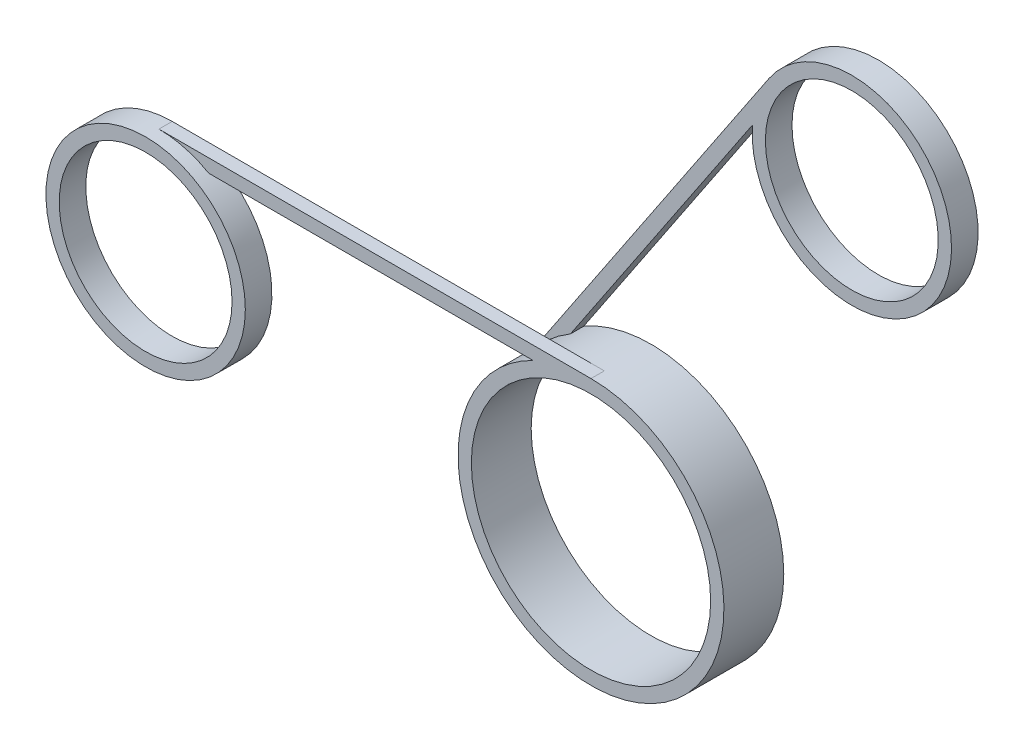
ISO-10303-21;
HEADER;
FILE_DESCRIPTION(('STEP AP214'),'2;1');
FILE_NAME('part.step','',(''),(''),'','','');
FILE_SCHEMA(('AUTOMOTIVE_DESIGN { 1 0 10303 214 1 1 1 1 }'));
ENDSEC;
DATA;
#1=APPLICATION_CONTEXT('core data for automotive mechanical design processes');
#2=APPLICATION_PROTOCOL_DEFINITION('international standard','automotive_design',2000,#1);
#3=PRODUCT_CONTEXT('',#1,'mechanical');
#4=PRODUCT('Part','Part','',(#3));
#5=PRODUCT_RELATED_PRODUCT_CATEGORY('part','',(#4));
#6=PRODUCT_DEFINITION_FORMATION('','',#4);
#7=PRODUCT_DEFINITION_CONTEXT('part definition',#1,'design');
#8=PRODUCT_DEFINITION('design','',#6,#7);
#9=PRODUCT_DEFINITION_SHAPE('','',#8);
#10=(LENGTH_UNIT() NAMED_UNIT(*) SI_UNIT(.MILLI.,.METRE.));
#11=(NAMED_UNIT(*) PLANE_ANGLE_UNIT() SI_UNIT($,.RADIAN.));
#12=(NAMED_UNIT(*) SI_UNIT($,.STERADIAN.) SOLID_ANGLE_UNIT());
#13=UNCERTAINTY_MEASURE_WITH_UNIT(LENGTH_MEASURE(1.E-05),#10,'distance_accuracy_value','');
#14=(GEOMETRIC_REPRESENTATION_CONTEXT(3) GLOBAL_UNCERTAINTY_ASSIGNED_CONTEXT((#13)) GLOBAL_UNIT_ASSIGNED_CONTEXT((#10,
#11,#12)) REPRESENTATION_CONTEXT('',''));
#15=CARTESIAN_POINT('',(0.,0.,0.));
#16=DIRECTION('',(0.,0.,1.));
#17=DIRECTION('',(1.,0.,0.));
#18=AXIS2_PLACEMENT_3D('',#15,#16,#17);
#19=CARTESIAN_POINT('',(10.7164950382095,32.1827826275243,1.));
#20=DIRECTION('',(0.830988464290159,-0.55628964777055,0.));
#21=DIRECTION('',(0.55628964777055,0.830988464290159,0.));
#22=AXIS2_PLACEMENT_3D('',#19,#20,#21);
#23=PLANE('',#22);
#24=DIRECTION('',(-0.55628964777055,-0.830988464290159,0.));
#25=VECTOR('',#24,1.);
#26=CARTESIAN_POINT('',(10.7164950382095,32.1827826275243,0.));
#27=LINE('',#26,#25);
#28=CARTESIAN_POINT('',(8.63502380081733,29.0734697112104,0.));
#29=VERTEX_POINT('',#28);
#30=CARTESIAN_POINT('',(-5.0494654380512,8.63150617157437,0.));
#31=VERTEX_POINT('',#30);
#32=EDGE_CURVE('E117',#29,#31,#27,.T.);
#33=ORIENTED_EDGE('',*,*,#32,.F.);
#34=DIRECTION('',(0.,0.,1.));
#35=VECTOR('',#34,1.);
#36=CARTESIAN_POINT('',(8.63502380081733,29.0734697112104,-1.));
#37=LINE('',#36,#35);
#38=CARTESIAN_POINT('',(8.63502380081733,29.0734697112104,1.));
#39=VERTEX_POINT('',#38);
#40=EDGE_CURVE('E106',#29,#39,#37,.T.);
#41=ORIENTED_EDGE('',*,*,#40,.T.);
#42=DIRECTION('',(-0.55628964777055,-0.830988464290159,0.));
#43=VECTOR('',#42,1.);
#44=CARTESIAN_POINT('',(10.7164950382095,32.1827826275243,1.));
#45=LINE('',#44,#43);
#46=CARTESIAN_POINT('',(-5.04946543805121,8.63150617157437,1.));
#47=VERTEX_POINT('',#46);
#48=EDGE_CURVE('E51',#39,#47,#45,.T.);
#49=ORIENTED_EDGE('',*,*,#48,.T.);
#50=DIRECTION('',(0.,0.,-1.));
#51=VECTOR('',#50,1.);
#52=CARTESIAN_POINT('',(-5.0494654380512,8.63150617157437,4.5));
#53=LINE('',#52,#51);
#54=EDGE_CURVE('E133',#31,#47,#53,.F.);
#55=ORIENTED_EDGE('',*,*,#54,.F.);
#56=EDGE_LOOP('',(#33,#41,#49,#55));
#57=FACE_BOUND('',#56,.T.);
#58=ADVANCED_FACE('F36',(#57),#23,.T.);
#59=CARTESIAN_POINT('',(0.,9.,3.5));
#60=DIRECTION('',(0.,-1.,0.));
#61=DIRECTION('',(0.,0.,-1.));
#62=AXIS2_PLACEMENT_3D('',#59,#60,#61);
#63=PLANE('',#62);
#64=DIRECTION('',(1.,0.,0.));
#65=VECTOR('',#64,1.);
#66=CARTESIAN_POINT('',(0.,9.,4.5));
#67=LINE('',#66,#65);
#68=CARTESIAN_POINT('',(-28.7583426132261,9.,4.5));
#69=VERTEX_POINT('',#68);
#70=CARTESIAN_POINT('',(-4.35889894354067,9.,4.5));
#71=VERTEX_POINT('',#70);
#72=EDGE_CURVE('E157',#69,#71,#67,.T.);
#73=ORIENTED_EDGE('',*,*,#72,.F.);
#74=DIRECTION('',(0.,0.,-1.));
#75=VECTOR('',#74,1.);
#76=CARTESIAN_POINT('',(-28.7583426132261,9.,5.5));
#77=LINE('',#76,#75);
#78=CARTESIAN_POINT('',(-28.7583426132261,9.,3.5));
#79=VERTEX_POINT('',#78);
#80=EDGE_CURVE('E149',#69,#79,#77,.T.);
#81=ORIENTED_EDGE('',*,*,#80,.T.);
#82=DIRECTION('',(1.,0.,0.));
#83=VECTOR('',#82,1.);
#84=CARTESIAN_POINT('',(0.,9.,3.5));
#85=LINE('',#84,#83);
#86=CARTESIAN_POINT('',(-4.35889894354067,9.,3.5));
#87=VERTEX_POINT('',#86);
#88=EDGE_CURVE('E156',#79,#87,#85,.T.);
#89=ORIENTED_EDGE('',*,*,#88,.T.);
#90=DIRECTION('',(0.,0.,-1.));
#91=VECTOR('',#90,1.);
#92=CARTESIAN_POINT('',(-4.35889894354067,9.,4.5));
#93=LINE('',#92,#91);
#94=EDGE_CURVE('E171',#71,#87,#93,.T.);
#95=ORIENTED_EDGE('',*,*,#94,.F.);
#96=EDGE_LOOP('',(#73,#81,#89,#95));
#97=FACE_BOUND('',#96,.T.);
#98=ADVANCED_FACE('F193',(#97),#63,.T.);
#99=CARTESIAN_POINT('',(0.,0.,4.5));
#100=DIRECTION('',(0.,0.,-1.));
#101=DIRECTION('',(-1.,0.,0.));
#102=AXIS2_PLACEMENT_3D('',#99,#100,#101);
#103=CYLINDRICAL_SURFACE('',#102,10.);
#104=CARTESIAN_POINT('',(0.,0.,0.));
#105=DIRECTION('',(0.,0.,1.));
#106=DIRECTION('',(1.,0.,0.));
#107=AXIS2_PLACEMENT_3D('',#104,#105,#106);
#108=CIRCLE('',#107,10.);
#109=CARTESIAN_POINT('',(-8.19409693482487,5.73208299160904,0.));
#110=VERTEX_POINT('',#109);
#111=EDGE_CURVE('E40',#110,#31,#108,.T.);
#112=ORIENTED_EDGE('',*,*,#111,.T.);
#113=ORIENTED_EDGE('',*,*,#54,.T.);
#114=CARTESIAN_POINT('',(0.,0.,1.));
#115=DIRECTION('',(0.,0.,-1.));
#116=DIRECTION('',(-1.,0.,0.));
#117=AXIS2_PLACEMENT_3D('',#114,#115,#116);
#118=CIRCLE('',#117,10.);
#119=CARTESIAN_POINT('',(-8.19409693482483,5.7320829916091,1.));
#120=VERTEX_POINT('',#119);
#121=EDGE_CURVE('E58',#120,#47,#118,.T.);
#122=ORIENTED_EDGE('',*,*,#121,.F.);
#123=DIRECTION('',(0.,0.,-1.));
#124=VECTOR('',#123,1.);
#125=CARTESIAN_POINT('',(-8.19409693482487,5.73208299160904,1.));
#126=LINE('',#125,#124);
#127=EDGE_CURVE('E122',#120,#110,#126,.T.);
#128=ORIENTED_EDGE('',*,*,#127,.T.);
#129=EDGE_LOOP('',(#112,#113,#122,#128));
#130=FACE_BOUND('',#129,.T.);
#131=CARTESIAN_POINT('',(0.,0.,4.5));
#132=DIRECTION('',(0.,0.,1.));
#133=DIRECTION('',(1.,0.,0.));
#134=AXIS2_PLACEMENT_3D('',#131,#132,#133);
#135=CIRCLE('',#134,10.);
#136=CARTESIAN_POINT('',(0.,10.,4.5));
#137=VERTEX_POINT('',#136);
#138=EDGE_CURVE('E11',#71,#137,#135,.T.);
#139=ORIENTED_EDGE('',*,*,#138,.F.);
#140=ORIENTED_EDGE('',*,*,#94,.T.);
#141=CARTESIAN_POINT('',(0.,0.,3.5));
#142=DIRECTION('',(0.,0.,-1.));
#143=DIRECTION('',(-1.,0.,0.));
#144=AXIS2_PLACEMENT_3D('',#141,#142,#143);
#145=CIRCLE('',#144,10.);
#146=CARTESIAN_POINT('',(0.,10.,3.5));
#147=VERTEX_POINT('',#146);
#148=EDGE_CURVE('E166',#87,#147,#145,.T.);
#149=ORIENTED_EDGE('',*,*,#148,.T.);
#150=DIRECTION('',(0.,0.,1.));
#151=VECTOR('',#150,1.);
#152=CARTESIAN_POINT('',(0.,10.,3.5));
#153=LINE('',#152,#151);
#154=EDGE_CURVE('E159',#147,#137,#153,.T.);
#155=ORIENTED_EDGE('',*,*,#154,.T.);
#156=EDGE_LOOP('',(#139,#140,#149,#155));
#157=FACE_BOUND('',#156,.T.);
#158=ADVANCED_FACE('F38',(#130,#157),#103,.T.);
#159=CARTESIAN_POINT('',(0.,0.,4.5));
#160=DIRECTION('',(0.,0.,1.));
#161=DIRECTION('',(1.,0.,0.));
#162=AXIS2_PLACEMENT_3D('',#159,#160,#161);
#163=PLANE('',#162);
#164=DIRECTION('',(-1.,0.,0.));
#165=VECTOR('',#164,1.);
#166=CARTESIAN_POINT('',(0.,10.,4.5));
#167=LINE('',#166,#165);
#168=CARTESIAN_POINT('',(-32.5,10.,4.5));
#169=VERTEX_POINT('',#168);
#170=EDGE_CURVE('E152',#137,#169,#167,.T.);
#171=ORIENTED_EDGE('',*,*,#170,.T.);
#172=CARTESIAN_POINT('',(-32.5,2.5,4.5));
#173=DIRECTION('',(0.,0.,1.));
#174=DIRECTION('',(1.,0.,0.));
#175=AXIS2_PLACEMENT_3D('',#172,#173,#174);
#176=CIRCLE('',#175,7.5);
#177=EDGE_CURVE('E145',#169,#69,#176,.F.);
#178=ORIENTED_EDGE('',*,*,#177,.T.);
#179=ORIENTED_EDGE('',*,*,#72,.T.);
#180=ORIENTED_EDGE('',*,*,#138,.T.);
#181=EDGE_LOOP('',(#171,#178,#179,#180));
#182=FACE_BOUND('',#181,.T.);
#183=CARTESIAN_POINT('',(0.,0.,4.5));
#184=DIRECTION('',(0.,0.,1.));
#185=DIRECTION('',(1.,0.,0.));
#186=AXIS2_PLACEMENT_3D('',#183,#184,#185);
#187=CIRCLE('',#186,9.);
#188=CARTESIAN_POINT('',(9.,0.,4.5));
#189=VERTEX_POINT('',#188);
#190=EDGE_CURVE('E174',#189,#189,#187,.T.);
#191=ORIENTED_EDGE('',*,*,#190,.F.);
#192=EDGE_LOOP('',(#191));
#193=FACE_BOUND('',#192,.T.);
#194=ADVANCED_FACE('F183',(#182,#193),#163,.T.);
#195=CARTESIAN_POINT('',(0.,0.,0.));
#196=DIRECTION('',(0.,0.,1.));
#197=DIRECTION('',(1.,0.,0.));
#198=AXIS2_PLACEMENT_3D('',#195,#196,#197);
#199=PLANE('',#198);
#200=CARTESIAN_POINT('',(16.1178940884926,28.5668611267723,0.));
#201=DIRECTION('',(0.,0.,1.));
#202=DIRECTION('',(1.,0.,0.));
#203=AXIS2_PLACEMENT_3D('',#200,#201,#202);
#204=CIRCLE('',#203,7.5);
#205=CARTESIAN_POINT('',(9.88551056893519,32.7390782430246,0.));
#206=VERTEX_POINT('',#205);
#207=EDGE_CURVE('E119',#29,#206,#204,.F.);
#208=ORIENTED_EDGE('',*,*,#207,.F.);
#209=ORIENTED_EDGE('',*,*,#32,.T.);
#210=ORIENTED_EDGE('',*,*,#111,.F.);
#211=DIRECTION('',(0.556295615500309,0.830984469274325,0.));
#212=VECTOR('',#211,1.);
#213=CARTESIAN_POINT('',(-8.19409693482487,5.73208299160904,0.));
#214=LINE('',#213,#212);
#215=EDGE_CURVE('E118',#110,#206,#214,.T.);
#216=ORIENTED_EDGE('',*,*,#215,.T.);
#217=EDGE_LOOP('',(#208,#209,#210,#216));
#218=FACE_BOUND('',#217,.T.);
#219=CARTESIAN_POINT('',(0.,0.,0.));
#220=DIRECTION('',(0.,0.,1.));
#221=DIRECTION('',(1.,0.,0.));
#222=AXIS2_PLACEMENT_3D('',#219,#220,#221);
#223=CIRCLE('',#222,9.);
#224=CARTESIAN_POINT('',(9.,0.,0.));
#225=VERTEX_POINT('',#224);
#226=EDGE_CURVE('E175',#225,#225,#223,.T.);
#227=ORIENTED_EDGE('',*,*,#226,.T.);
#228=EDGE_LOOP('',(#227));
#229=FACE_BOUND('',#228,.T.);
#230=ADVANCED_FACE('F185',(#218,#229),#199,.F.);
#231=CARTESIAN_POINT('',(0.,0.,0.));
#232=DIRECTION('',(0.,0.,1.));
#233=DIRECTION('',(1.,0.,0.));
#234=AXIS2_PLACEMENT_3D('',#231,#232,#233);
#235=CYLINDRICAL_SURFACE('',#234,9.);
#236=ORIENTED_EDGE('',*,*,#226,.F.);
#237=EDGE_LOOP('',(#236));
#238=FACE_BOUND('',#237,.T.);
#239=ORIENTED_EDGE('',*,*,#190,.T.);
#240=EDGE_LOOP('',(#239));
#241=FACE_BOUND('',#240,.T.);
#242=ADVANCED_FACE('F181',(#238,#241),#235,.F.);
#243=CARTESIAN_POINT('',(0.,0.,3.5));
#244=DIRECTION('',(0.,0.,-1.));
#245=DIRECTION('',(-1.,0.,0.));
#246=AXIS2_PLACEMENT_3D('',#243,#244,#245);
#247=PLANE('',#246);
#248=CARTESIAN_POINT('',(-32.5,2.5,3.5));
#249=DIRECTION('',(0.,0.,1.));
#250=DIRECTION('',(1.,0.,0.));
#251=AXIS2_PLACEMENT_3D('',#248,#249,#250);
#252=CIRCLE('',#251,6.5);
#253=CARTESIAN_POINT('',(-26.,2.5,3.5));
#254=VERTEX_POINT('',#253);
#255=EDGE_CURVE('E136',#254,#254,#252,.T.);
#256=ORIENTED_EDGE('',*,*,#255,.T.);
#257=EDGE_LOOP('',(#256));
#258=FACE_BOUND('',#257,.T.);
#259=ORIENTED_EDGE('',*,*,#88,.F.);
#260=CARTESIAN_POINT('',(-32.5,2.5,3.5));
#261=DIRECTION('',(0.,0.,1.));
#262=DIRECTION('',(1.,0.,0.));
#263=AXIS2_PLACEMENT_3D('',#260,#261,#262);
#264=CIRCLE('',#263,7.5);
#265=CARTESIAN_POINT('',(-32.5,10.,3.5));
#266=VERTEX_POINT('',#265);
#267=EDGE_CURVE('E139',#266,#79,#264,.T.);
#268=ORIENTED_EDGE('',*,*,#267,.F.);
#269=DIRECTION('',(-1.,0.,0.));
#270=VECTOR('',#269,1.);
#271=CARTESIAN_POINT('',(0.,10.,3.5));
#272=LINE('',#271,#270);
#273=EDGE_CURVE('E153',#147,#266,#272,.T.);
#274=ORIENTED_EDGE('',*,*,#273,.F.);
#275=ORIENTED_EDGE('',*,*,#148,.F.);
#276=EDGE_LOOP('',(#259,#268,#274,#275));
#277=FACE_BOUND('',#276,.T.);
#278=ADVANCED_FACE('F222',(#258,#277),#247,.T.);
#279=CARTESIAN_POINT('',(0.,10.,3.5));
#280=DIRECTION('',(0.,1.,0.));
#281=DIRECTION('',(-1.,0.,0.));
#282=AXIS2_PLACEMENT_3D('',#279,#280,#281);
#283=PLANE('',#282);
#284=ORIENTED_EDGE('',*,*,#170,.F.);
#285=ORIENTED_EDGE('',*,*,#154,.F.);
#286=ORIENTED_EDGE('',*,*,#273,.T.);
#287=DIRECTION('',(0.,0.,1.));
#288=VECTOR('',#287,1.);
#289=CARTESIAN_POINT('',(-32.5,10.,3.5));
#290=LINE('',#289,#288);
#291=EDGE_CURVE('E163',#266,#169,#290,.T.);
#292=ORIENTED_EDGE('',*,*,#291,.T.);
#293=EDGE_LOOP('',(#284,#285,#286,#292));
#294=FACE_BOUND('',#293,.T.);
#295=ADVANCED_FACE('F220',(#294),#283,.T.);
#296=CARTESIAN_POINT('',(-32.5,2.5,5.5));
#297=DIRECTION('',(0.,0.,-1.));
#298=DIRECTION('',(-1.,0.,0.));
#299=AXIS2_PLACEMENT_3D('',#296,#297,#298);
#300=CYLINDRICAL_SURFACE('',#299,7.5);
#301=ORIENTED_EDGE('',*,*,#80,.F.);
#302=ORIENTED_EDGE('',*,*,#177,.F.);
#303=ORIENTED_EDGE('',*,*,#291,.F.);
#304=ORIENTED_EDGE('',*,*,#267,.T.);
#305=EDGE_LOOP('',(#301,#302,#303,#304));
#306=FACE_BOUND('',#305,.T.);
#307=CARTESIAN_POINT('',(-32.5,2.5,5.5));
#308=DIRECTION('',(0.,0.,1.));
#309=DIRECTION('',(1.,0.,0.));
#310=AXIS2_PLACEMENT_3D('',#307,#308,#309);
#311=CIRCLE('',#310,7.5);
#312=CARTESIAN_POINT('',(-25.,2.5,5.5));
#313=VERTEX_POINT('',#312);
#314=EDGE_CURVE('E142',#313,#313,#311,.T.);
#315=ORIENTED_EDGE('',*,*,#314,.F.);
#316=EDGE_LOOP('',(#315));
#317=FACE_BOUND('',#316,.T.);
#318=ADVANCED_FACE('F216',(#306,#317),#300,.T.);
#319=CARTESIAN_POINT('',(-32.5,2.5,5.5));
#320=DIRECTION('',(0.,0.,1.));
#321=DIRECTION('',(1.,0.,0.));
#322=AXIS2_PLACEMENT_3D('',#319,#320,#321);
#323=PLANE('',#322);
#324=CARTESIAN_POINT('',(-32.5,2.5,5.5));
#325=DIRECTION('',(0.,0.,1.));
#326=DIRECTION('',(1.,0.,0.));
#327=AXIS2_PLACEMENT_3D('',#324,#325,#326);
#328=CIRCLE('',#327,6.5);
#329=CARTESIAN_POINT('',(-26.,2.5,5.5));
#330=VERTEX_POINT('',#329);
#331=EDGE_CURVE('E135',#330,#330,#328,.T.);
#332=ORIENTED_EDGE('',*,*,#331,.F.);
#333=EDGE_LOOP('',(#332));
#334=FACE_BOUND('',#333,.T.);
#335=ORIENTED_EDGE('',*,*,#314,.T.);
#336=EDGE_LOOP('',(#335));
#337=FACE_BOUND('',#336,.T.);
#338=ADVANCED_FACE('F212',(#334,#337),#323,.T.);
#339=CARTESIAN_POINT('',(-32.5,2.5,3.5));
#340=DIRECTION('',(0.,0.,1.));
#341=DIRECTION('',(1.,0.,0.));
#342=AXIS2_PLACEMENT_3D('',#339,#340,#341);
#343=CYLINDRICAL_SURFACE('',#342,6.5);
#344=ORIENTED_EDGE('',*,*,#255,.F.);
#345=EDGE_LOOP('',(#344));
#346=FACE_BOUND('',#345,.T.);
#347=ORIENTED_EDGE('',*,*,#331,.T.);
#348=EDGE_LOOP('',(#347));
#349=FACE_BOUND('',#348,.T.);
#350=ADVANCED_FACE('F209',(#346,#349),#343,.F.);
#351=CARTESIAN_POINT('',(0.,0.,1.));
#352=DIRECTION('',(0.,0.,-1.));
#353=DIRECTION('',(-1.,0.,0.));
#354=AXIS2_PLACEMENT_3D('',#351,#352,#353);
#355=PLANE('',#354);
#356=CARTESIAN_POINT('',(16.1178940884926,28.5668611267723,1.));
#357=DIRECTION('',(0.,0.,-1.));
#358=DIRECTION('',(-1.,0.,0.));
#359=AXIS2_PLACEMENT_3D('',#356,#357,#358);
#360=CIRCLE('',#359,6.5);
#361=CARTESIAN_POINT('',(9.61789408849261,28.5668611267723,1.));
#362=VERTEX_POINT('',#361);
#363=EDGE_CURVE('E114',#362,#362,#360,.T.);
#364=ORIENTED_EDGE('',*,*,#363,.T.);
#365=EDGE_LOOP('',(#364));
#366=FACE_BOUND('',#365,.T.);
#367=ORIENTED_EDGE('',*,*,#48,.F.);
#368=CARTESIAN_POINT('',(16.1178940884926,28.5668611267723,1.));
#369=DIRECTION('',(0.,0.,-1.));
#370=DIRECTION('',(-1.,0.,0.));
#371=AXIS2_PLACEMENT_3D('',#368,#369,#370);
#372=CIRCLE('',#371,7.5);
#373=CARTESIAN_POINT('',(9.88551056893517,32.7390782430246,1.));
#374=VERTEX_POINT('',#373);
#375=EDGE_CURVE('E103',#374,#39,#372,.T.);
#376=ORIENTED_EDGE('',*,*,#375,.F.);
#377=DIRECTION('',(0.556295615500309,0.830984469274325,0.));
#378=VECTOR('',#377,1.);
#379=CARTESIAN_POINT('',(-8.19409693482487,5.73208299160904,1.));
#380=LINE('',#379,#378);
#381=EDGE_CURVE('E123',#120,#374,#380,.T.);
#382=ORIENTED_EDGE('',*,*,#381,.F.);
#383=ORIENTED_EDGE('',*,*,#121,.T.);
#384=EDGE_LOOP('',(#367,#376,#382,#383));
#385=FACE_BOUND('',#384,.T.);
#386=ADVANCED_FACE('F121',(#366,#385),#355,.F.);
#387=CARTESIAN_POINT('',(-8.19409693482487,5.73208299160904,1.));
#388=DIRECTION('',(-0.830984469274325,0.556295615500309,0.));
#389=DIRECTION('',(-0.556295615500309,-0.830984469274325,0.));
#390=AXIS2_PLACEMENT_3D('',#387,#388,#389);
#391=PLANE('',#390);
#392=ORIENTED_EDGE('',*,*,#215,.F.);
#393=ORIENTED_EDGE('',*,*,#127,.F.);
#394=ORIENTED_EDGE('',*,*,#381,.T.);
#395=DIRECTION('',(0.,0.,-1.));
#396=VECTOR('',#395,1.);
#397=CARTESIAN_POINT('',(9.88551056893519,32.7390782430246,1.));
#398=LINE('',#397,#396);
#399=EDGE_CURVE('E109',#374,#206,#398,.T.);
#400=ORIENTED_EDGE('',*,*,#399,.T.);
#401=EDGE_LOOP('',(#392,#393,#394,#400));
#402=FACE_BOUND('',#401,.T.);
#403=ADVANCED_FACE('F205',(#402),#391,.T.);
#404=CARTESIAN_POINT('',(16.1178940884926,28.5668611267723,-1.));
#405=DIRECTION('',(0.,0.,1.));
#406=DIRECTION('',(1.,0.,0.));
#407=AXIS2_PLACEMENT_3D('',#404,#405,#406);
#408=CYLINDRICAL_SURFACE('',#407,7.5);
#409=ORIENTED_EDGE('',*,*,#40,.F.);
#410=ORIENTED_EDGE('',*,*,#207,.T.);
#411=ORIENTED_EDGE('',*,*,#399,.F.);
#412=ORIENTED_EDGE('',*,*,#375,.T.);
#413=EDGE_LOOP('',(#409,#410,#411,#412));
#414=FACE_BOUND('',#413,.T.);
#415=CARTESIAN_POINT('',(16.1178940884926,28.5668611267723,-1.));
#416=DIRECTION('',(0.,0.,-1.));
#417=DIRECTION('',(-1.,0.,0.));
#418=AXIS2_PLACEMENT_3D('',#415,#416,#417);
#419=CIRCLE('',#418,7.5);
#420=CARTESIAN_POINT('',(8.61789408849261,28.5668611267723,-1.));
#421=VERTEX_POINT('',#420);
#422=EDGE_CURVE('E113',#421,#421,#419,.T.);
#423=ORIENTED_EDGE('',*,*,#422,.F.);
#424=EDGE_LOOP('',(#423));
#425=FACE_BOUND('',#424,.T.);
#426=ADVANCED_FACE('F104',(#414,#425),#408,.T.);
#427=CARTESIAN_POINT('',(16.1178940884926,28.5668611267723,-1.));
#428=DIRECTION('',(0.,0.,-1.));
#429=DIRECTION('',(-1.,0.,0.));
#430=AXIS2_PLACEMENT_3D('',#427,#428,#429);
#431=PLANE('',#430);
#432=CARTESIAN_POINT('',(16.1178940884926,28.5668611267723,-1.));
#433=DIRECTION('',(0.,0.,-1.));
#434=DIRECTION('',(-1.,0.,0.));
#435=AXIS2_PLACEMENT_3D('',#432,#433,#434);
#436=CIRCLE('',#435,6.5);
#437=CARTESIAN_POINT('',(9.61789408849261,28.5668611267723,-1.));
#438=VERTEX_POINT('',#437);
#439=EDGE_CURVE('E352',#438,#438,#436,.T.);
#440=ORIENTED_EDGE('',*,*,#439,.F.);
#441=EDGE_LOOP('',(#440));
#442=FACE_BOUND('',#441,.T.);
#443=ORIENTED_EDGE('',*,*,#422,.T.);
#444=EDGE_LOOP('',(#443));
#445=FACE_BOUND('',#444,.T.);
#446=ADVANCED_FACE('F274',(#442,#445),#431,.T.);
#447=CARTESIAN_POINT('',(16.1178940884926,28.5668611267723,1.));
#448=DIRECTION('',(0.,0.,-1.));
#449=DIRECTION('',(-1.,0.,0.));
#450=AXIS2_PLACEMENT_3D('',#447,#448,#449);
#451=CYLINDRICAL_SURFACE('',#450,6.5);
#452=ORIENTED_EDGE('',*,*,#363,.F.);
#453=EDGE_LOOP('',(#452));
#454=FACE_BOUND('',#453,.T.);
#455=ORIENTED_EDGE('',*,*,#439,.T.);
#456=EDGE_LOOP('',(#455));
#457=FACE_BOUND('',#456,.T.);
#458=ADVANCED_FACE('F279',(#454,#457),#451,.F.);
#459=CLOSED_SHELL('',(#58,#98,#158,#194,#230,#242,#278,#295,#318,#338,#350,#386,#403,#426,#446,#458));
#460=MANIFOLD_SOLID_BREP('B2',#459);
#461=ADVANCED_BREP_SHAPE_REPRESENTATION('',(#18,#460),#14);
#462=SHAPE_DEFINITION_REPRESENTATION(#9,#461);
ENDSEC;
END-ISO-10303-21;
